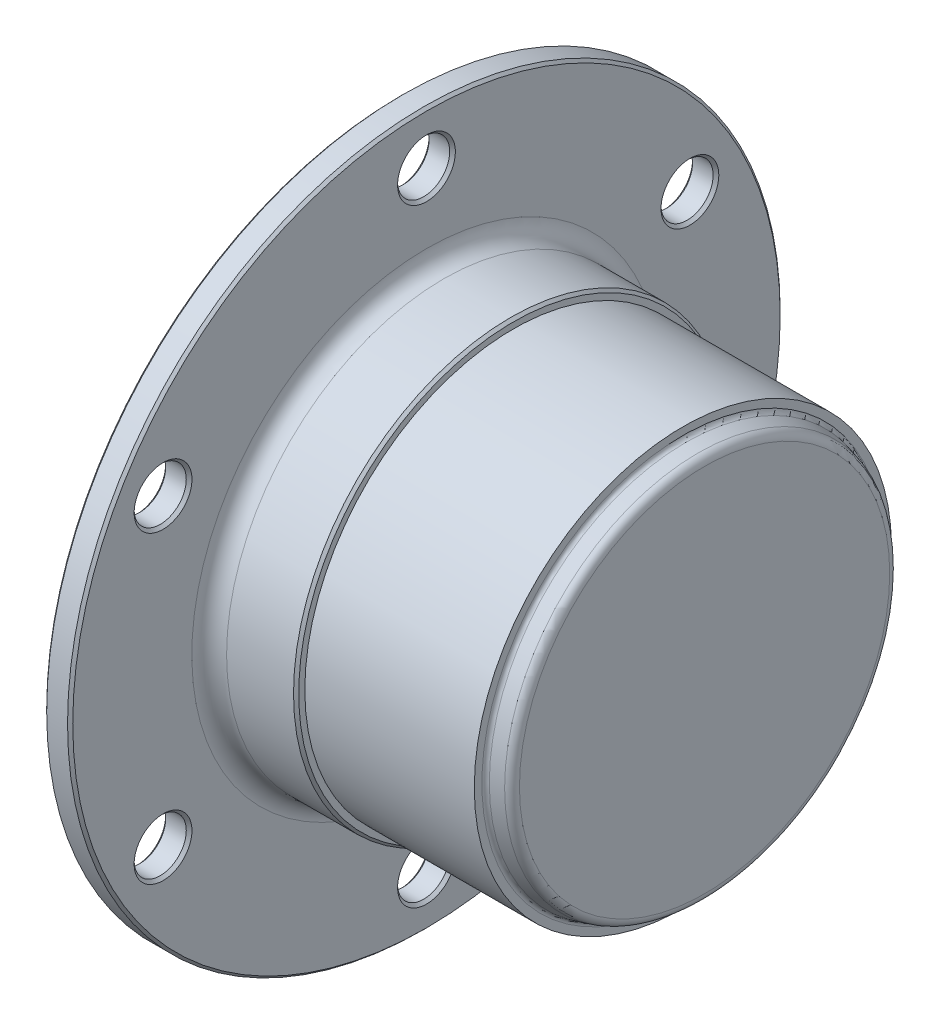
ISO-10303-21;
HEADER;
FILE_DESCRIPTION(('STEP AP214'),'2;1');
FILE_NAME('part.step','',(''),(''),'','','');
FILE_SCHEMA(('AUTOMOTIVE_DESIGN { 1 0 10303 214 1 1 1 1 }'));
ENDSEC;
DATA;
#1=APPLICATION_CONTEXT('core data for automotive mechanical design processes');
#2=APPLICATION_PROTOCOL_DEFINITION('international standard','automotive_design',2000,#1);
#3=PRODUCT_CONTEXT('',#1,'mechanical');
#4=PRODUCT('Part','Part','',(#3));
#5=PRODUCT_RELATED_PRODUCT_CATEGORY('part','',(#4));
#6=PRODUCT_DEFINITION_FORMATION('','',#4);
#7=PRODUCT_DEFINITION_CONTEXT('part definition',#1,'design');
#8=PRODUCT_DEFINITION('design','',#6,#7);
#9=PRODUCT_DEFINITION_SHAPE('','',#8);
#10=(LENGTH_UNIT() NAMED_UNIT(*) SI_UNIT(.MILLI.,.METRE.));
#11=(NAMED_UNIT(*) PLANE_ANGLE_UNIT() SI_UNIT($,.RADIAN.));
#12=(NAMED_UNIT(*) SI_UNIT($,.STERADIAN.) SOLID_ANGLE_UNIT());
#13=UNCERTAINTY_MEASURE_WITH_UNIT(LENGTH_MEASURE(1.E-05),#10,'distance_accuracy_value','');
#14=(GEOMETRIC_REPRESENTATION_CONTEXT(3) GLOBAL_UNCERTAINTY_ASSIGNED_CONTEXT((#13)) GLOBAL_UNIT_ASSIGNED_CONTEXT((#10,
#11,#12)) REPRESENTATION_CONTEXT('',''));
#15=CARTESIAN_POINT('',(0.,0.,0.));
#16=DIRECTION('',(0.,0.,1.));
#17=DIRECTION('',(1.,0.,0.));
#18=AXIS2_PLACEMENT_3D('',#15,#16,#17);
#19=CARTESIAN_POINT('',(0.,0.,0.));
#20=DIRECTION('',(1.,0.,0.));
#21=DIRECTION('',(0.,1.,0.));
#22=AXIS2_PLACEMENT_3D('',#19,#20,#21);
#23=CYLINDRICAL_SURFACE('',#22,41.);
#24=CARTESIAN_POINT('',(2.70000000022191,0.,0.));
#25=DIRECTION('',(1.,0.,0.));
#26=DIRECTION('',(0.,1.,0.));
#27=AXIS2_PLACEMENT_3D('',#24,#25,#26);
#28=CIRCLE('',#27,41.);
#29=CARTESIAN_POINT('',(2.70000000022191,41.,0.));
#30=VERTEX_POINT('',#29);
#31=EDGE_CURVE('E54',#30,#30,#28,.F.);
#32=ORIENTED_EDGE('',*,*,#31,.T.);
#33=EDGE_LOOP('',(#32));
#34=FACE_BOUND('',#33,.T.);
#35=CARTESIAN_POINT('',(0.300000000347714,0.,0.));
#36=DIRECTION('',(-1.,0.,0.));
#37=DIRECTION('',(0.,-1.,0.));
#38=AXIS2_PLACEMENT_3D('',#35,#36,#37);
#39=CIRCLE('',#38,41.);
#40=CARTESIAN_POINT('',(0.300000000347714,-41.,0.));
#41=VERTEX_POINT('',#40);
#42=EDGE_CURVE('E57',#41,#41,#39,.F.);
#43=ORIENTED_EDGE('',*,*,#42,.T.);
#44=EDGE_LOOP('',(#43));
#45=FACE_BOUND('',#44,.T.);
#46=ADVANCED_FACE('F31',(#34,#45),#23,.T.);
#47=CARTESIAN_POINT('',(3.,27.,0.));
#48=DIRECTION('',(1.,0.,0.));
#49=DIRECTION('',(0.,1.,0.));
#50=AXIS2_PLACEMENT_3D('',#47,#48,#49);
#51=PLANE('',#50);
#52=CARTESIAN_POINT('',(3.,0.,0.));
#53=DIRECTION('',(1.,0.,0.));
#54=DIRECTION('',(0.,1.,0.));
#55=AXIS2_PLACEMENT_3D('',#52,#53,#54);
#56=CIRCLE('',#55,40.6999999996523);
#57=CARTESIAN_POINT('',(3.,40.6999999996523,0.));
#58=VERTEX_POINT('',#57);
#59=EDGE_CURVE('E60',#58,#58,#56,.T.);
#60=ORIENTED_EDGE('',*,*,#59,.T.);
#61=EDGE_LOOP('',(#60));
#62=FACE_BOUND('',#61,.T.);
#63=CARTESIAN_POINT('',(3.,-17.5,30.3108891324554));
#64=DIRECTION('',(1.,0.,0.));
#65=DIRECTION('',(0.,0.,-1.));
#66=AXIS2_PLACEMENT_3D('',#63,#64,#65);
#67=CIRCLE('',#66,3.32689611788558);
#68=CARTESIAN_POINT('',(3.,-17.5,26.9839930145698));
#69=VERTEX_POINT('',#68);
#70=EDGE_CURVE('E150',#69,#69,#67,.T.);
#71=ORIENTED_EDGE('',*,*,#70,.F.);
#72=EDGE_LOOP('',(#71));
#73=FACE_BOUND('',#72,.T.);
#74=CARTESIAN_POINT('',(3.,17.5,30.3108891324554));
#75=DIRECTION('',(1.,0.,0.));
#76=DIRECTION('',(0.,0.,-1.));
#77=AXIS2_PLACEMENT_3D('',#74,#75,#76);
#78=CIRCLE('',#77,3.32689611788558);
#79=CARTESIAN_POINT('',(3.,17.5,26.9839930145698));
#80=VERTEX_POINT('',#79);
#81=EDGE_CURVE('E144',#80,#80,#78,.T.);
#82=ORIENTED_EDGE('',*,*,#81,.F.);
#83=EDGE_LOOP('',(#82));
#84=FACE_BOUND('',#83,.T.);
#85=CARTESIAN_POINT('',(3.,35.,0.));
#86=DIRECTION('',(1.,0.,0.));
#87=DIRECTION('',(0.,0.,-1.));
#88=AXIS2_PLACEMENT_3D('',#85,#86,#87);
#89=CIRCLE('',#88,3.32689611788557);
#90=CARTESIAN_POINT('',(3.,35.,-3.32689611788557));
#91=VERTEX_POINT('',#90);
#92=EDGE_CURVE('E138',#91,#91,#89,.T.);
#93=ORIENTED_EDGE('',*,*,#92,.F.);
#94=EDGE_LOOP('',(#93));
#95=FACE_BOUND('',#94,.T.);
#96=CARTESIAN_POINT('',(3.,17.5,-30.3108891324554));
#97=DIRECTION('',(1.,0.,0.));
#98=DIRECTION('',(0.,0.,-1.));
#99=AXIS2_PLACEMENT_3D('',#96,#97,#98);
#100=CIRCLE('',#99,3.32689611788558);
#101=CARTESIAN_POINT('',(3.,17.5,-33.6377852503409));
#102=VERTEX_POINT('',#101);
#103=EDGE_CURVE('E132',#102,#102,#100,.T.);
#104=ORIENTED_EDGE('',*,*,#103,.F.);
#105=EDGE_LOOP('',(#104));
#106=FACE_BOUND('',#105,.T.);
#107=CARTESIAN_POINT('',(3.,-17.5,-30.3108891324553));
#108=DIRECTION('',(1.,0.,0.));
#109=DIRECTION('',(0.,0.,-1.));
#110=AXIS2_PLACEMENT_3D('',#107,#108,#109);
#111=CIRCLE('',#110,3.32689611788558);
#112=CARTESIAN_POINT('',(3.,-17.5,-33.6377852503409));
#113=VERTEX_POINT('',#112);
#114=EDGE_CURVE('E126',#113,#113,#111,.T.);
#115=ORIENTED_EDGE('',*,*,#114,.F.);
#116=EDGE_LOOP('',(#115));
#117=FACE_BOUND('',#116,.T.);
#118=CARTESIAN_POINT('',(3.,-35.,0.));
#119=DIRECTION('',(1.,0.,0.));
#120=DIRECTION('',(0.,0.,-1.));
#121=AXIS2_PLACEMENT_3D('',#118,#119,#120);
#122=CIRCLE('',#121,3.32689611788557);
#123=CARTESIAN_POINT('',(3.,-35.,-3.32689611788557));
#124=VERTEX_POINT('',#123);
#125=EDGE_CURVE('E120',#124,#124,#122,.T.);
#126=ORIENTED_EDGE('',*,*,#125,.F.);
#127=EDGE_LOOP('',(#126));
#128=FACE_BOUND('',#127,.T.);
#129=CARTESIAN_POINT('',(2.99999999999998,0.,0.));
#130=DIRECTION('',(1.,0.,0.));
#131=DIRECTION('',(0.,1.,0.));
#132=AXIS2_PLACEMENT_3D('',#129,#130,#131);
#133=CIRCLE('',#132,27.);
#134=CARTESIAN_POINT('',(2.99999999999998,27.,0.));
#135=VERTEX_POINT('',#134);
#136=EDGE_CURVE('E99',#135,#135,#133,.T.);
#137=ORIENTED_EDGE('',*,*,#136,.F.);
#138=EDGE_LOOP('',(#137));
#139=FACE_BOUND('',#138,.T.);
#140=ADVANCED_FACE('F156',(#62,#73,#84,#95,#106,#117,#128,#139),#51,.T.);
#141=CARTESIAN_POINT('',(5.,0.,0.));
#142=DIRECTION('',(1.,0.,0.));
#143=DIRECTION('',(0.,1.,0.));
#144=AXIS2_PLACEMENT_3D('',#141,#142,#143);
#145=TOROIDAL_SURFACE('',#144,27.,2.00000000000002);
#146=ORIENTED_EDGE('',*,*,#136,.T.);
#147=EDGE_LOOP('',(#146));
#148=FACE_BOUND('',#147,.T.);
#149=CARTESIAN_POINT('',(5.00000000000002,0.,0.));
#150=DIRECTION('',(1.,0.,0.));
#151=DIRECTION('',(0.,1.,0.));
#152=AXIS2_PLACEMENT_3D('',#149,#150,#151);
#153=CIRCLE('',#152,25.);
#154=CARTESIAN_POINT('',(5.00000000000002,25.,0.));
#155=VERTEX_POINT('',#154);
#156=EDGE_CURVE('E102',#155,#155,#153,.T.);
#157=ORIENTED_EDGE('',*,*,#156,.F.);
#158=EDGE_LOOP('',(#157));
#159=FACE_BOUND('',#158,.T.);
#160=ADVANCED_FACE('F159',(#148,#159),#145,.F.);
#161=CARTESIAN_POINT('',(0.,41.,0.));
#162=DIRECTION('',(-1.,0.,0.));
#163=DIRECTION('',(0.,-1.,0.));
#164=AXIS2_PLACEMENT_3D('',#161,#162,#163);
#165=PLANE('',#164);
#166=CARTESIAN_POINT('',(0.,35.,0.));
#167=DIRECTION('',(-1.,0.,0.));
#168=DIRECTION('',(0.,-1.,0.));
#169=AXIS2_PLACEMENT_3D('',#166,#167,#168);
#170=CIRCLE('',#169,3.30000000034772);
#171=CARTESIAN_POINT('',(0.,31.6999999996523,0.));
#172=VERTEX_POINT('',#171);
#173=EDGE_CURVE('E78',#172,#172,#170,.F.);
#174=ORIENTED_EDGE('',*,*,#173,.T.);
#175=EDGE_LOOP('',(#174));
#176=FACE_BOUND('',#175,.T.);
#177=CARTESIAN_POINT('',(0.,-17.5,-30.3108891324553));
#178=DIRECTION('',(-1.,0.,0.));
#179=DIRECTION('',(0.,-1.,0.));
#180=AXIS2_PLACEMENT_3D('',#177,#178,#179);
#181=CIRCLE('',#180,3.30000000034773);
#182=CARTESIAN_POINT('',(0.,-20.8000000003477,-30.3108891324553));
#183=VERTEX_POINT('',#182);
#184=EDGE_CURVE('E81',#183,#183,#181,.F.);
#185=ORIENTED_EDGE('',*,*,#184,.T.);
#186=EDGE_LOOP('',(#185));
#187=FACE_BOUND('',#186,.T.);
#188=CARTESIAN_POINT('',(0.,17.5,30.3108891324554));
#189=DIRECTION('',(-1.,0.,0.));
#190=DIRECTION('',(0.,-1.,0.));
#191=AXIS2_PLACEMENT_3D('',#188,#189,#190);
#192=CIRCLE('',#191,3.30000000034773);
#193=CARTESIAN_POINT('',(0.,14.1999999996523,30.3108891324554));
#194=VERTEX_POINT('',#193);
#195=EDGE_CURVE('E84',#194,#194,#192,.F.);
#196=ORIENTED_EDGE('',*,*,#195,.T.);
#197=EDGE_LOOP('',(#196));
#198=FACE_BOUND('',#197,.T.);
#199=CARTESIAN_POINT('',(0.,17.5,-30.3108891324554));
#200=DIRECTION('',(-1.,0.,0.));
#201=DIRECTION('',(0.,-1.,0.));
#202=AXIS2_PLACEMENT_3D('',#199,#200,#201);
#203=CIRCLE('',#202,3.30000000034773);
#204=CARTESIAN_POINT('',(0.,14.1999999996522,-30.3108891324554));
#205=VERTEX_POINT('',#204);
#206=EDGE_CURVE('E87',#205,#205,#203,.F.);
#207=ORIENTED_EDGE('',*,*,#206,.T.);
#208=EDGE_LOOP('',(#207));
#209=FACE_BOUND('',#208,.T.);
#210=CARTESIAN_POINT('',(0.,-35.,0.));
#211=DIRECTION('',(-1.,0.,0.));
#212=DIRECTION('',(0.,-1.,0.));
#213=AXIS2_PLACEMENT_3D('',#210,#211,#212);
#214=CIRCLE('',#213,3.30000000034772);
#215=CARTESIAN_POINT('',(0.,-38.3000000003477,0.));
#216=VERTEX_POINT('',#215);
#217=EDGE_CURVE('E90',#216,#216,#214,.F.);
#218=ORIENTED_EDGE('',*,*,#217,.T.);
#219=EDGE_LOOP('',(#218));
#220=FACE_BOUND('',#219,.T.);
#221=CARTESIAN_POINT('',(0.,0.,0.));
#222=DIRECTION('',(-1.,0.,0.));
#223=DIRECTION('',(0.,-1.,0.));
#224=AXIS2_PLACEMENT_3D('',#221,#222,#223);
#225=CIRCLE('',#224,40.7000000002219);
#226=CARTESIAN_POINT('',(0.,-40.7000000002219,0.));
#227=VERTEX_POINT('',#226);
#228=EDGE_CURVE('E93',#227,#227,#225,.T.);
#229=ORIENTED_EDGE('',*,*,#228,.T.);
#230=EDGE_LOOP('',(#229));
#231=FACE_BOUND('',#230,.T.);
#232=CARTESIAN_POINT('',(0.,-17.5,30.3108891324554));
#233=DIRECTION('',(-1.,0.,0.));
#234=DIRECTION('',(0.,-1.,0.));
#235=AXIS2_PLACEMENT_3D('',#232,#233,#234);
#236=CIRCLE('',#235,3.30000000034774);
#237=CARTESIAN_POINT('',(0.,-20.8000000003477,30.3108891324554));
#238=VERTEX_POINT('',#237);
#239=EDGE_CURVE('E96',#238,#238,#236,.F.);
#240=ORIENTED_EDGE('',*,*,#239,.T.);
#241=EDGE_LOOP('',(#240));
#242=FACE_BOUND('',#241,.T.);
#243=ADVANCED_FACE('F176',(#176,#187,#198,#209,#220,#231,#242),#165,.T.);
#244=CARTESIAN_POINT('',(12.7,0.,0.));
#245=DIRECTION('',(-1.,0.,0.));
#246=DIRECTION('',(0.,0.,1.));
#247=AXIS2_PLACEMENT_3D('',#244,#245,#246);
#248=CYLINDRICAL_SURFACE('',#247,25.);
#249=CARTESIAN_POINT('',(12.7,0.,0.));
#250=DIRECTION('',(1.,0.,0.));
#251=DIRECTION('',(0.,0.,-1.));
#252=AXIS2_PLACEMENT_3D('',#249,#250,#251);
#253=CIRCLE('',#252,25.);
#254=CARTESIAN_POINT('',(12.7,0.,-25.));
#255=VERTEX_POINT('',#254);
#256=EDGE_CURVE('E105',#255,#255,#253,.T.);
#257=ORIENTED_EDGE('',*,*,#256,.F.);
#258=EDGE_LOOP('',(#257));
#259=FACE_BOUND('',#258,.T.);
#260=ORIENTED_EDGE('',*,*,#156,.T.);
#261=EDGE_LOOP('',(#260));
#262=FACE_BOUND('',#261,.T.);
#263=ADVANCED_FACE('F180',(#259,#262),#248,.T.);
#264=CARTESIAN_POINT('',(12.7,0.,0.));
#265=DIRECTION('',(-1.,0.,0.));
#266=DIRECTION('',(0.,0.,-1.));
#267=AXIS2_PLACEMENT_3D('',#264,#265,#266);
#268=CONICAL_SURFACE('',#267,24.9999999997308,0.785398162499986);
#269=CARTESIAN_POINT('',(13.,0.,0.));
#270=DIRECTION('',(1.,0.,0.));
#271=DIRECTION('',(0.,0.,-1.));
#272=AXIS2_PLACEMENT_3D('',#269,#270,#271);
#273=CIRCLE('',#272,24.7000000002692);
#274=CARTESIAN_POINT('',(13.,0.,-24.7000000002692));
#275=VERTEX_POINT('',#274);
#276=EDGE_CURVE('E108',#275,#275,#273,.T.);
#277=ORIENTED_EDGE('',*,*,#276,.F.);
#278=EDGE_LOOP('',(#277));
#279=FACE_BOUND('',#278,.T.);
#280=ORIENTED_EDGE('',*,*,#256,.T.);
#281=EDGE_LOOP('',(#280));
#282=FACE_BOUND('',#281,.T.);
#283=ADVANCED_FACE('F182',(#279,#282),#268,.T.);
#284=CARTESIAN_POINT('',(13.,0.,0.));
#285=DIRECTION('',(1.,0.,0.));
#286=DIRECTION('',(0.,0.,-1.));
#287=AXIS2_PLACEMENT_3D('',#284,#285,#286);
#288=PLANE('',#287);
#289=CARTESIAN_POINT('',(13.,0.,0.));
#290=DIRECTION('',(1.,0.,0.));
#291=DIRECTION('',(0.,0.,-1.));
#292=AXIS2_PLACEMENT_3D('',#289,#290,#291);
#293=CIRCLE('',#292,24.);
#294=CARTESIAN_POINT('',(13.,0.,-24.));
#295=VERTEX_POINT('',#294);
#296=EDGE_CURVE('E112',#295,#295,#293,.T.);
#297=ORIENTED_EDGE('',*,*,#296,.F.);
#298=EDGE_LOOP('',(#297));
#299=FACE_BOUND('',#298,.T.);
#300=ORIENTED_EDGE('',*,*,#276,.T.);
#301=EDGE_LOOP('',(#300));
#302=FACE_BOUND('',#301,.T.);
#303=ADVANCED_FACE('F189',(#299,#302),#288,.T.);
#304=CARTESIAN_POINT('',(32.5,0.,0.));
#305=DIRECTION('',(-1.,0.,0.));
#306=DIRECTION('',(0.,0.,1.));
#307=AXIS2_PLACEMENT_3D('',#304,#305,#306);
#308=CYLINDRICAL_SURFACE('',#307,24.);
#309=CARTESIAN_POINT('',(32.5,0.,0.));
#310=DIRECTION('',(1.,0.,0.));
#311=DIRECTION('',(0.,0.,-1.));
#312=AXIS2_PLACEMENT_3D('',#309,#310,#311);
#313=CIRCLE('',#312,24.);
#314=CARTESIAN_POINT('',(32.5,0.,-24.));
#315=VERTEX_POINT('',#314);
#316=EDGE_CURVE('E111',#315,#315,#313,.T.);
#317=ORIENTED_EDGE('',*,*,#316,.F.);
#318=EDGE_LOOP('',(#317));
#319=FACE_BOUND('',#318,.T.);
#320=ORIENTED_EDGE('',*,*,#296,.T.);
#321=EDGE_LOOP('',(#320));
#322=FACE_BOUND('',#321,.T.);
#323=ADVANCED_FACE('F255',(#319,#322),#308,.T.);
#324=CARTESIAN_POINT('',(32.5,0.,0.));
#325=DIRECTION('',(1.,0.,0.));
#326=DIRECTION('',(0.,0.,-1.));
#327=AXIS2_PLACEMENT_3D('',#324,#325,#326);
#328=PLANE('',#327);
#329=CARTESIAN_POINT('',(32.5,0.,0.));
#330=DIRECTION('',(1.,0.,0.));
#331=DIRECTION('',(0.,0.,-1.));
#332=AXIS2_PLACEMENT_3D('',#329,#330,#331);
#333=CIRCLE('',#332,23.1246156956212);
#334=CARTESIAN_POINT('',(32.5,0.,-23.1246156956212));
#335=VERTEX_POINT('',#334);
#336=EDGE_CURVE('E42',#335,#335,#333,.F.);
#337=ORIENTED_EDGE('',*,*,#336,.T.);
#338=EDGE_LOOP('',(#337));
#339=FACE_BOUND('',#338,.T.);
#340=ORIENTED_EDGE('',*,*,#316,.T.);
#341=EDGE_LOOP('',(#340));
#342=FACE_BOUND('',#341,.T.);
#343=ADVANCED_FACE('F247',(#339,#342),#328,.T.);
#344=CARTESIAN_POINT('',(32.5,0.,0.));
#345=DIRECTION('',(-1.,0.,0.));
#346=DIRECTION('',(0.,0.,-1.));
#347=AXIS2_PLACEMENT_3D('',#344,#345,#346);
#348=CONICAL_SURFACE('',#347,22.741139955119,0.262272168863289);
#349=CARTESIAN_POINT('',(34.2592756875997,0.,0.));
#350=DIRECTION('',(-1.,0.,0.));
#351=DIRECTION('',(0.,0.,1.));
#352=AXIS2_PLACEMENT_3D('',#349,#350,#351);
#353=CIRCLE('',#352,22.2688518729946);
#354=CARTESIAN_POINT('',(34.2592756875997,0.,22.2688518729946));
#355=VERTEX_POINT('',#354);
#356=EDGE_CURVE('E10',#355,#355,#353,.T.);
#357=ORIENTED_EDGE('',*,*,#356,.T.);
#358=EDGE_LOOP('',(#357));
#359=FACE_BOUND('',#358,.T.);
#360=CARTESIAN_POINT('',(32.8703621562002,0.,0.));
#361=DIRECTION('',(1.,0.,0.));
#362=DIRECTION('',(0.,0.,-1.));
#363=AXIS2_PLACEMENT_3D('',#360,#361,#362);
#364=CIRCLE('',#363,22.6417140188225);
#365=CARTESIAN_POINT('',(32.8703621562002,0.,-22.6417140188225));
#366=VERTEX_POINT('',#365);
#367=EDGE_CURVE('E46',#366,#366,#364,.T.);
#368=ORIENTED_EDGE('',*,*,#367,.T.);
#369=EDGE_LOOP('',(#368));
#370=FACE_BOUND('',#369,.T.);
#371=ADVANCED_FACE('F244',(#359,#370),#348,.T.);
#372=CARTESIAN_POINT('',(35.,0.,0.));
#373=DIRECTION('',(1.,0.,0.));
#374=DIRECTION('',(0.,0.,-1.));
#375=AXIS2_PLACEMENT_3D('',#372,#373,#374);
#376=PLANE('',#375);
#377=CARTESIAN_POINT('',(35.,0.,0.));
#378=DIRECTION('',(1.,0.,0.));
#379=DIRECTION('',(0.,0.,-1.));
#380=AXIS2_PLACEMENT_3D('',#377,#378,#379);
#381=CIRCLE('',#380,21.3030485193973);
#382=CARTESIAN_POINT('',(35.,0.,-21.3030485193973));
#383=VERTEX_POINT('',#382);
#384=EDGE_CURVE('E38',#383,#383,#381,.T.);
#385=ORIENTED_EDGE('',*,*,#384,.T.);
#386=EDGE_LOOP('',(#385));
#387=FACE_BOUND('',#386,.T.);
#388=ADVANCED_FACE('F246',(#387),#376,.T.);
#389=CARTESIAN_POINT('',(3.,-35.,0.));
#390=DIRECTION('',(1.,0.,0.));
#391=DIRECTION('',(0.,0.,-1.));
#392=AXIS2_PLACEMENT_3D('',#389,#390,#391);
#393=CYLINDRICAL_SURFACE('',#392,2.99999999999999);
#394=CARTESIAN_POINT('',(0.299999999778088,-35.,0.));
#395=DIRECTION('',(-1.,0.,0.));
#396=DIRECTION('',(0.,0.,1.));
#397=AXIS2_PLACEMENT_3D('',#394,#395,#396);
#398=CIRCLE('',#397,2.99999999999999);
#399=CARTESIAN_POINT('',(0.299999999778088,-35.,2.99999999999999));
#400=VERTEX_POINT('',#399);
#401=EDGE_CURVE('E63',#400,#400,#398,.T.);
#402=ORIENTED_EDGE('',*,*,#401,.T.);
#403=EDGE_LOOP('',(#402));
#404=FACE_BOUND('',#403,.T.);
#405=CARTESIAN_POINT('',(2.67310388154058,-35.,0.));
#406=DIRECTION('',(1.,0.,0.));
#407=DIRECTION('',(0.,0.,-1.));
#408=AXIS2_PLACEMENT_3D('',#405,#406,#407);
#409=CIRCLE('',#408,2.99999999999999);
#410=CARTESIAN_POINT('',(2.67310388154058,-35.,-2.99999999999999));
#411=VERTEX_POINT('',#410);
#412=EDGE_CURVE('E115',#411,#411,#409,.T.);
#413=ORIENTED_EDGE('',*,*,#412,.T.);
#414=EDGE_LOOP('',(#413));
#415=FACE_BOUND('',#414,.T.);
#416=ADVANCED_FACE('F253',(#404,#415),#393,.F.);
#417=CARTESIAN_POINT('',(3.,-35.,0.));
#418=DIRECTION('',(1.,0.,0.));
#419=DIRECTION('',(0.,0.,-1.));
#420=AXIS2_PLACEMENT_3D('',#417,#418,#419);
#421=CONICAL_SURFACE('',#420,3.32689611788557,0.785398162519747);
#422=ORIENTED_EDGE('',*,*,#412,.F.);
#423=EDGE_LOOP('',(#422));
#424=FACE_BOUND('',#423,.T.);
#425=ORIENTED_EDGE('',*,*,#125,.T.);
#426=EDGE_LOOP('',(#425));
#427=FACE_BOUND('',#426,.T.);
#428=ADVANCED_FACE('F316',(#424,#427),#421,.F.);
#429=CARTESIAN_POINT('',(3.,-17.5,-30.3108891324553));
#430=DIRECTION('',(1.,0.,0.));
#431=DIRECTION('',(0.,0.,-1.));
#432=AXIS2_PLACEMENT_3D('',#429,#430,#431);
#433=CYLINDRICAL_SURFACE('',#432,2.99999999999999);
#434=CARTESIAN_POINT('',(0.299999999778108,-17.5,-30.3108891324553));
#435=DIRECTION('',(-1.,0.,0.));
#436=DIRECTION('',(0.,0.,1.));
#437=AXIS2_PLACEMENT_3D('',#434,#435,#436);
#438=CIRCLE('',#437,2.99999999999999);
#439=CARTESIAN_POINT('',(0.299999999778108,-17.5,-27.3108891324554));
#440=VERTEX_POINT('',#439);
#441=EDGE_CURVE('E72',#440,#440,#438,.T.);
#442=ORIENTED_EDGE('',*,*,#441,.T.);
#443=EDGE_LOOP('',(#442));
#444=FACE_BOUND('',#443,.T.);
#445=CARTESIAN_POINT('',(2.67310388154058,-17.5,-30.3108891324553));
#446=DIRECTION('',(1.,0.,0.));
#447=DIRECTION('',(0.,0.,-1.));
#448=AXIS2_PLACEMENT_3D('',#445,#446,#447);
#449=CIRCLE('',#448,2.99999999999999);
#450=CARTESIAN_POINT('',(2.67310388154058,-17.5,-33.3108891324553));
#451=VERTEX_POINT('',#450);
#452=EDGE_CURVE('E123',#451,#451,#449,.T.);
#453=ORIENTED_EDGE('',*,*,#452,.T.);
#454=EDGE_LOOP('',(#453));
#455=FACE_BOUND('',#454,.T.);
#456=ADVANCED_FACE('F323',(#444,#455),#433,.F.);
#457=CARTESIAN_POINT('',(3.,-17.5,-30.3108891324553));
#458=DIRECTION('',(1.,0.,0.));
#459=DIRECTION('',(0.,0.,-1.));
#460=AXIS2_PLACEMENT_3D('',#457,#458,#459);
#461=CONICAL_SURFACE('',#460,3.32689611788558,0.785398162519757);
#462=ORIENTED_EDGE('',*,*,#452,.F.);
#463=EDGE_LOOP('',(#462));
#464=FACE_BOUND('',#463,.T.);
#465=ORIENTED_EDGE('',*,*,#114,.T.);
#466=EDGE_LOOP('',(#465));
#467=FACE_BOUND('',#466,.T.);
#468=ADVANCED_FACE('F331',(#464,#467),#461,.F.);
#469=CARTESIAN_POINT('',(3.,17.5,-30.3108891324554));
#470=DIRECTION('',(1.,0.,0.));
#471=DIRECTION('',(0.,0.,-1.));
#472=AXIS2_PLACEMENT_3D('',#469,#470,#471);
#473=CYLINDRICAL_SURFACE('',#472,2.99999999999999);
#474=CARTESIAN_POINT('',(0.299999999778108,17.5,-30.3108891324554));
#475=DIRECTION('',(-1.,0.,0.));
#476=DIRECTION('',(0.,0.,1.));
#477=AXIS2_PLACEMENT_3D('',#474,#475,#476);
#478=CIRCLE('',#477,2.99999999999999);
#479=CARTESIAN_POINT('',(0.299999999778108,17.5,-27.3108891324554));
#480=VERTEX_POINT('',#479);
#481=EDGE_CURVE('E66',#480,#480,#478,.T.);
#482=ORIENTED_EDGE('',*,*,#481,.T.);
#483=EDGE_LOOP('',(#482));
#484=FACE_BOUND('',#483,.T.);
#485=CARTESIAN_POINT('',(2.67310388154058,17.5,-30.3108891324554));
#486=DIRECTION('',(1.,0.,0.));
#487=DIRECTION('',(0.,0.,-1.));
#488=AXIS2_PLACEMENT_3D('',#485,#486,#487);
#489=CIRCLE('',#488,2.99999999999999);
#490=CARTESIAN_POINT('',(2.67310388154058,17.5,-33.3108891324554));
#491=VERTEX_POINT('',#490);
#492=EDGE_CURVE('E129',#491,#491,#489,.T.);
#493=ORIENTED_EDGE('',*,*,#492,.T.);
#494=EDGE_LOOP('',(#493));
#495=FACE_BOUND('',#494,.T.);
#496=ADVANCED_FACE('F339',(#484,#495),#473,.F.);
#497=CARTESIAN_POINT('',(3.,17.5,-30.3108891324554));
#498=DIRECTION('',(1.,0.,0.));
#499=DIRECTION('',(0.,0.,-1.));
#500=AXIS2_PLACEMENT_3D('',#497,#498,#499);
#501=CONICAL_SURFACE('',#500,3.32689611788558,0.785398162519757);
#502=ORIENTED_EDGE('',*,*,#492,.F.);
#503=EDGE_LOOP('',(#502));
#504=FACE_BOUND('',#503,.T.);
#505=ORIENTED_EDGE('',*,*,#103,.T.);
#506=EDGE_LOOP('',(#505));
#507=FACE_BOUND('',#506,.T.);
#508=ADVANCED_FACE('F347',(#504,#507),#501,.F.);
#509=CARTESIAN_POINT('',(3.,35.,0.));
#510=DIRECTION('',(1.,0.,0.));
#511=DIRECTION('',(0.,0.,-1.));
#512=AXIS2_PLACEMENT_3D('',#509,#510,#511);
#513=CYLINDRICAL_SURFACE('',#512,2.99999999999999);
#514=CARTESIAN_POINT('',(0.299999999778088,35.,0.));
#515=DIRECTION('',(-1.,0.,0.));
#516=DIRECTION('',(0.,0.,1.));
#517=AXIS2_PLACEMENT_3D('',#514,#515,#516);
#518=CIRCLE('',#517,2.99999999999999);
#519=CARTESIAN_POINT('',(0.299999999778088,35.,2.99999999999999));
#520=VERTEX_POINT('',#519);
#521=EDGE_CURVE('E75',#520,#520,#518,.T.);
#522=ORIENTED_EDGE('',*,*,#521,.T.);
#523=EDGE_LOOP('',(#522));
#524=FACE_BOUND('',#523,.T.);
#525=CARTESIAN_POINT('',(2.67310388154058,35.,0.));
#526=DIRECTION('',(1.,0.,0.));
#527=DIRECTION('',(0.,0.,-1.));
#528=AXIS2_PLACEMENT_3D('',#525,#526,#527);
#529=CIRCLE('',#528,2.99999999999999);
#530=CARTESIAN_POINT('',(2.67310388154058,35.,-2.99999999999999));
#531=VERTEX_POINT('',#530);
#532=EDGE_CURVE('E135',#531,#531,#529,.T.);
#533=ORIENTED_EDGE('',*,*,#532,.T.);
#534=EDGE_LOOP('',(#533));
#535=FACE_BOUND('',#534,.T.);
#536=ADVANCED_FACE('F355',(#524,#535),#513,.F.);
#537=CARTESIAN_POINT('',(3.,35.,0.));
#538=DIRECTION('',(1.,0.,0.));
#539=DIRECTION('',(0.,0.,-1.));
#540=AXIS2_PLACEMENT_3D('',#537,#538,#539);
#541=CONICAL_SURFACE('',#540,3.32689611788557,0.785398162519747);
#542=ORIENTED_EDGE('',*,*,#532,.F.);
#543=EDGE_LOOP('',(#542));
#544=FACE_BOUND('',#543,.T.);
#545=ORIENTED_EDGE('',*,*,#92,.T.);
#546=EDGE_LOOP('',(#545));
#547=FACE_BOUND('',#546,.T.);
#548=ADVANCED_FACE('F363',(#544,#547),#541,.F.);
#549=CARTESIAN_POINT('',(3.,17.5,30.3108891324554));
#550=DIRECTION('',(1.,0.,0.));
#551=DIRECTION('',(0.,0.,-1.));
#552=AXIS2_PLACEMENT_3D('',#549,#550,#551);
#553=CYLINDRICAL_SURFACE('',#552,2.99999999999999);
#554=CARTESIAN_POINT('',(0.299999999778108,17.5,30.3108891324554));
#555=DIRECTION('',(-1.,0.,0.));
#556=DIRECTION('',(0.,0.,1.));
#557=AXIS2_PLACEMENT_3D('',#554,#555,#556);
#558=CIRCLE('',#557,2.99999999999999);
#559=CARTESIAN_POINT('',(0.299999999778108,17.5,33.3108891324553));
#560=VERTEX_POINT('',#559);
#561=EDGE_CURVE('E69',#560,#560,#558,.T.);
#562=ORIENTED_EDGE('',*,*,#561,.T.);
#563=EDGE_LOOP('',(#562));
#564=FACE_BOUND('',#563,.T.);
#565=CARTESIAN_POINT('',(2.67310388154058,17.5,30.3108891324554));
#566=DIRECTION('',(1.,0.,0.));
#567=DIRECTION('',(0.,0.,-1.));
#568=AXIS2_PLACEMENT_3D('',#565,#566,#567);
#569=CIRCLE('',#568,2.99999999999999);
#570=CARTESIAN_POINT('',(2.67310388154058,17.5,27.3108891324554));
#571=VERTEX_POINT('',#570);
#572=EDGE_CURVE('E141',#571,#571,#569,.T.);
#573=ORIENTED_EDGE('',*,*,#572,.T.);
#574=EDGE_LOOP('',(#573));
#575=FACE_BOUND('',#574,.T.);
#576=ADVANCED_FACE('F371',(#564,#575),#553,.F.);
#577=CARTESIAN_POINT('',(3.,17.5,30.3108891324554));
#578=DIRECTION('',(1.,0.,0.));
#579=DIRECTION('',(0.,0.,-1.));
#580=AXIS2_PLACEMENT_3D('',#577,#578,#579);
#581=CONICAL_SURFACE('',#580,3.32689611788558,0.785398162519757);
#582=ORIENTED_EDGE('',*,*,#572,.F.);
#583=EDGE_LOOP('',(#582));
#584=FACE_BOUND('',#583,.T.);
#585=ORIENTED_EDGE('',*,*,#81,.T.);
#586=EDGE_LOOP('',(#585));
#587=FACE_BOUND('',#586,.T.);
#588=ADVANCED_FACE('F379',(#584,#587),#581,.F.);
#589=CARTESIAN_POINT('',(3.,-17.5,30.3108891324554));
#590=DIRECTION('',(1.,0.,0.));
#591=DIRECTION('',(0.,0.,-1.));
#592=AXIS2_PLACEMENT_3D('',#589,#590,#591);
#593=CYLINDRICAL_SURFACE('',#592,2.99999999999999);
#594=CARTESIAN_POINT('',(0.299999999778108,-17.5,30.3108891324554));
#595=DIRECTION('',(-1.,0.,0.));
#596=DIRECTION('',(0.,0.,1.));
#597=AXIS2_PLACEMENT_3D('',#594,#595,#596);
#598=CIRCLE('',#597,2.99999999999999);
#599=CARTESIAN_POINT('',(0.299999999778108,-17.5,33.3108891324553));
#600=VERTEX_POINT('',#599);
#601=EDGE_CURVE('E51',#600,#600,#598,.T.);
#602=ORIENTED_EDGE('',*,*,#601,.T.);
#603=EDGE_LOOP('',(#602));
#604=FACE_BOUND('',#603,.T.);
#605=CARTESIAN_POINT('',(2.67310388154058,-17.5,30.3108891324554));
#606=DIRECTION('',(1.,0.,0.));
#607=DIRECTION('',(0.,0.,-1.));
#608=AXIS2_PLACEMENT_3D('',#605,#606,#607);
#609=CIRCLE('',#608,2.99999999999999);
#610=CARTESIAN_POINT('',(2.67310388154058,-17.5,27.3108891324554));
#611=VERTEX_POINT('',#610);
#612=EDGE_CURVE('E147',#611,#611,#609,.T.);
#613=ORIENTED_EDGE('',*,*,#612,.T.);
#614=EDGE_LOOP('',(#613));
#615=FACE_BOUND('',#614,.T.);
#616=ADVANCED_FACE('F387',(#604,#615),#593,.F.);
#617=CARTESIAN_POINT('',(3.,-17.5,30.3108891324554));
#618=DIRECTION('',(1.,0.,0.));
#619=DIRECTION('',(0.,0.,-1.));
#620=AXIS2_PLACEMENT_3D('',#617,#618,#619);
#621=CONICAL_SURFACE('',#620,3.32689611788558,0.785398162519757);
#622=ORIENTED_EDGE('',*,*,#612,.F.);
#623=EDGE_LOOP('',(#622));
#624=FACE_BOUND('',#623,.T.);
#625=ORIENTED_EDGE('',*,*,#70,.T.);
#626=EDGE_LOOP('',(#625));
#627=FACE_BOUND('',#626,.T.);
#628=ADVANCED_FACE('F154',(#624,#627),#621,.F.);
#629=CARTESIAN_POINT('',(0.,35.,0.));
#630=DIRECTION('',(-1.,0.,0.));
#631=DIRECTION('',(0.,0.,1.));
#632=AXIS2_PLACEMENT_3D('',#629,#630,#631);
#633=CONICAL_SURFACE('',#632,3.30000000034772,0.785398164346849);
#634=ORIENTED_EDGE('',*,*,#521,.F.);
#635=EDGE_LOOP('',(#634));
#636=FACE_BOUND('',#635,.T.);
#637=ORIENTED_EDGE('',*,*,#173,.F.);
#638=EDGE_LOOP('',(#637));
#639=FACE_BOUND('',#638,.T.);
#640=ADVANCED_FACE('F202',(#636,#639),#633,.F.);
#641=CARTESIAN_POINT('',(0.,-17.5,-30.3108891324553));
#642=DIRECTION('',(-1.,0.,0.));
#643=DIRECTION('',(0.,0.,1.));
#644=AXIS2_PLACEMENT_3D('',#641,#642,#643);
#645=CONICAL_SURFACE('',#644,3.30000000034773,0.785398164346843);
#646=ORIENTED_EDGE('',*,*,#441,.F.);
#647=EDGE_LOOP('',(#646));
#648=FACE_BOUND('',#647,.T.);
#649=ORIENTED_EDGE('',*,*,#184,.F.);
#650=EDGE_LOOP('',(#649));
#651=FACE_BOUND('',#650,.T.);
#652=ADVANCED_FACE('F205',(#648,#651),#645,.F.);
#653=CARTESIAN_POINT('',(0.,17.5,30.3108891324554));
#654=DIRECTION('',(-1.,0.,0.));
#655=DIRECTION('',(0.,0.,1.));
#656=AXIS2_PLACEMENT_3D('',#653,#654,#655);
#657=CONICAL_SURFACE('',#656,3.30000000034773,0.785398164346837);
#658=ORIENTED_EDGE('',*,*,#561,.F.);
#659=EDGE_LOOP('',(#658));
#660=FACE_BOUND('',#659,.T.);
#661=ORIENTED_EDGE('',*,*,#195,.F.);
#662=EDGE_LOOP('',(#661));
#663=FACE_BOUND('',#662,.T.);
#664=ADVANCED_FACE('F209',(#660,#663),#657,.F.);
#665=CARTESIAN_POINT('',(0.,17.5,-30.3108891324554));
#666=DIRECTION('',(-1.,0.,0.));
#667=DIRECTION('',(0.,0.,1.));
#668=AXIS2_PLACEMENT_3D('',#665,#666,#667);
#669=CONICAL_SURFACE('',#668,3.30000000034773,0.785398164346843);
#670=ORIENTED_EDGE('',*,*,#481,.F.);
#671=EDGE_LOOP('',(#670));
#672=FACE_BOUND('',#671,.T.);
#673=ORIENTED_EDGE('',*,*,#206,.F.);
#674=EDGE_LOOP('',(#673));
#675=FACE_BOUND('',#674,.T.);
#676=ADVANCED_FACE('F213',(#672,#675),#669,.F.);
#677=CARTESIAN_POINT('',(0.,-35.,0.));
#678=DIRECTION('',(-1.,0.,0.));
#679=DIRECTION('',(0.,0.,1.));
#680=AXIS2_PLACEMENT_3D('',#677,#678,#679);
#681=CONICAL_SURFACE('',#680,3.30000000034772,0.785398164346849);
#682=ORIENTED_EDGE('',*,*,#401,.F.);
#683=EDGE_LOOP('',(#682));
#684=FACE_BOUND('',#683,.T.);
#685=ORIENTED_EDGE('',*,*,#217,.F.);
#686=EDGE_LOOP('',(#685));
#687=FACE_BOUND('',#686,.T.);
#688=ADVANCED_FACE('F217',(#684,#687),#681,.F.);
#689=CARTESIAN_POINT('',(3.,0.,0.));
#690=DIRECTION('',(-1.,0.,0.));
#691=DIRECTION('',(0.,-1.,0.));
#692=AXIS2_PLACEMENT_3D('',#689,#690,#691);
#693=CONICAL_SURFACE('',#692,40.6999999996523,0.785398164346862);
#694=ORIENTED_EDGE('',*,*,#31,.F.);
#695=EDGE_LOOP('',(#694));
#696=FACE_BOUND('',#695,.T.);
#697=ORIENTED_EDGE('',*,*,#59,.F.);
#698=EDGE_LOOP('',(#697));
#699=FACE_BOUND('',#698,.T.);
#700=ADVANCED_FACE('F221',(#696,#699),#693,.T.);
#701=CARTESIAN_POINT('',(0.300000000347714,0.,0.));
#702=DIRECTION('',(1.,0.,0.));
#703=DIRECTION('',(0.,1.,0.));
#704=AXIS2_PLACEMENT_3D('',#701,#702,#703);
#705=CONICAL_SURFACE('',#704,41.,0.785398162448046);
#706=ORIENTED_EDGE('',*,*,#228,.F.);
#707=EDGE_LOOP('',(#706));
#708=FACE_BOUND('',#707,.T.);
#709=ORIENTED_EDGE('',*,*,#42,.F.);
#710=EDGE_LOOP('',(#709));
#711=FACE_BOUND('',#710,.T.);
#712=ADVANCED_FACE('F225',(#708,#711),#705,.T.);
#713=CARTESIAN_POINT('',(0.,-17.5,30.3108891324554));
#714=DIRECTION('',(-1.,0.,0.));
#715=DIRECTION('',(0.,0.,1.));
#716=AXIS2_PLACEMENT_3D('',#713,#714,#715);
#717=CONICAL_SURFACE('',#716,3.30000000034774,0.785398164346849);
#718=ORIENTED_EDGE('',*,*,#601,.F.);
#719=EDGE_LOOP('',(#718));
#720=FACE_BOUND('',#719,.T.);
#721=ORIENTED_EDGE('',*,*,#239,.F.);
#722=EDGE_LOOP('',(#721));
#723=FACE_BOUND('',#722,.T.);
#724=ADVANCED_FACE('F229',(#720,#723),#717,.F.);
#725=CARTESIAN_POINT('',(33.,0.,0.));
#726=DIRECTION('',(1.,0.,0.));
#727=DIRECTION('',(0.,0.,-1.));
#728=AXIS2_PLACEMENT_3D('',#725,#726,#727);
#729=TOROIDAL_SURFACE('',#728,23.1246156956212,0.500000000000003);
#730=ORIENTED_EDGE('',*,*,#336,.F.);
#731=EDGE_LOOP('',(#730));
#732=FACE_BOUND('',#731,.T.);
#733=ORIENTED_EDGE('',*,*,#367,.F.);
#734=EDGE_LOOP('',(#733));
#735=FACE_BOUND('',#734,.T.);
#736=ADVANCED_FACE('F232',(#732,#735),#729,.F.);
#737=CARTESIAN_POINT('',(34.,0.,0.));
#738=DIRECTION('',(1.,0.,0.));
#739=DIRECTION('',(0.,0.,-1.));
#740=AXIS2_PLACEMENT_3D('',#737,#738,#739);
#741=TOROIDAL_SURFACE('',#740,21.3030485193973,1.);
#742=ORIENTED_EDGE('',*,*,#356,.F.);
#743=EDGE_LOOP('',(#742));
#744=FACE_BOUND('',#743,.T.);
#745=ORIENTED_EDGE('',*,*,#384,.F.);
#746=EDGE_LOOP('',(#745));
#747=FACE_BOUND('',#746,.T.);
#748=ADVANCED_FACE('F33',(#744,#747),#741,.T.);
#749=CLOSED_SHELL('',(#46,#140,#160,#243,#263,#283,#303,#323,#343,#371,#388,#416,#428,#456,#468,
#496,#508,#536,#548,#576,#588,#616,#628,#640,#652,#664,#676,#688,#700,#712,#724,#736,#748));
#750=MANIFOLD_SOLID_BREP('B2',#749);
#751=ADVANCED_BREP_SHAPE_REPRESENTATION('',(#18,#750),#14);
#752=SHAPE_DEFINITION_REPRESENTATION(#9,#751);
ENDSEC;
END-ISO-10303-21;
